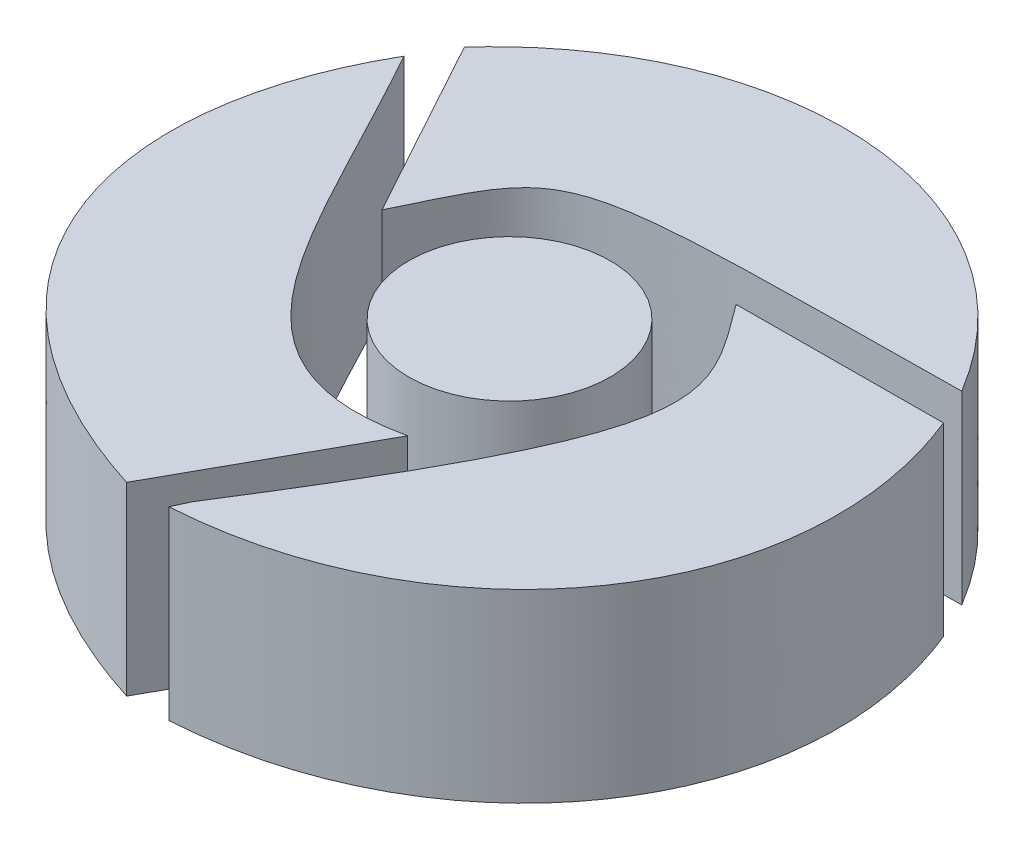
ISO-10303-21;
HEADER;
FILE_DESCRIPTION(('STEP AP214'),'2;1');
FILE_NAME('part.step','',(''),(''),'','','');
FILE_SCHEMA(('AUTOMOTIVE_DESIGN { 1 0 10303 214 1 1 1 1 }'));
ENDSEC;
DATA;
#1=APPLICATION_CONTEXT('core data for automotive mechanical design processes');
#2=APPLICATION_PROTOCOL_DEFINITION('international standard','automotive_design',2000,#1);
#3=PRODUCT_CONTEXT('',#1,'mechanical');
#4=PRODUCT('Part','Part','',(#3));
#5=PRODUCT_RELATED_PRODUCT_CATEGORY('part','',(#4));
#6=PRODUCT_DEFINITION_FORMATION('','',#4);
#7=PRODUCT_DEFINITION_CONTEXT('part definition',#1,'design');
#8=PRODUCT_DEFINITION('design','',#6,#7);
#9=PRODUCT_DEFINITION_SHAPE('','',#8);
#10=(LENGTH_UNIT() NAMED_UNIT(*) SI_UNIT(.MILLI.,.METRE.));
#11=(NAMED_UNIT(*) PLANE_ANGLE_UNIT() SI_UNIT($,.RADIAN.));
#12=(NAMED_UNIT(*) SI_UNIT($,.STERADIAN.) SOLID_ANGLE_UNIT());
#13=UNCERTAINTY_MEASURE_WITH_UNIT(LENGTH_MEASURE(1.E-05),#10,'distance_accuracy_value','');
#14=(GEOMETRIC_REPRESENTATION_CONTEXT(3) GLOBAL_UNCERTAINTY_ASSIGNED_CONTEXT((#13)) GLOBAL_UNIT_ASSIGNED_CONTEXT((#10,
#11,#12)) REPRESENTATION_CONTEXT('',''));
#15=CARTESIAN_POINT('',(0.,0.,0.));
#16=DIRECTION('',(0.,0.,1.));
#17=DIRECTION('',(1.,0.,0.));
#18=AXIS2_PLACEMENT_3D('',#15,#16,#17);
#19=CARTESIAN_POINT('',(4.49369282645748,2.,-4.37720896751852));
#20=DIRECTION('',(0.,-1.,0.));
#21=DIRECTION('',(0.,0.,-1.));
#22=AXIS2_PLACEMENT_3D('',#19,#20,#21);
#23=CYLINDRICAL_SURFACE('',#22,1.08827277645075);
#24=CARTESIAN_POINT('',(4.49369282645748,2.,-4.37720896751852));
#25=DIRECTION('',(0.,1.,0.));
#26=DIRECTION('',(0.,0.,1.));
#27=AXIS2_PLACEMENT_3D('',#24,#25,#26);
#28=CIRCLE('',#27,1.08827277645075);
#29=CARTESIAN_POINT('',(4.49369282645748,2.,-3.28893619106777));
#30=VERTEX_POINT('',#29);
#31=EDGE_CURVE('E11',#30,#30,#28,.T.);
#32=ORIENTED_EDGE('',*,*,#31,.F.);
#33=EDGE_LOOP('',(#32));
#34=FACE_BOUND('',#33,.T.);
#35=CARTESIAN_POINT('',(4.49369282645748,0.,-4.37720896751852));
#36=DIRECTION('',(0.,1.,0.));
#37=DIRECTION('',(0.,0.,1.));
#38=AXIS2_PLACEMENT_3D('',#35,#36,#37);
#39=CIRCLE('',#38,1.08827277645075);
#40=CARTESIAN_POINT('',(4.49369282645748,0.,-3.28893619106777));
#41=VERTEX_POINT('',#40);
#42=EDGE_CURVE('E45',#41,#41,#39,.T.);
#43=ORIENTED_EDGE('',*,*,#42,.T.);
#44=EDGE_LOOP('',(#43));
#45=FACE_BOUND('',#44,.T.);
#46=ADVANCED_FACE('F42',(#34,#45),#23,.T.);
#47=CARTESIAN_POINT('',(4.49369282645748,2.,-4.37720896751852));
#48=DIRECTION('',(0.,1.,0.));
#49=DIRECTION('',(0.,0.,1.));
#50=AXIS2_PLACEMENT_3D('',#47,#48,#49);
#51=PLANE('',#50);
#52=ORIENTED_EDGE('',*,*,#31,.T.);
#53=EDGE_LOOP('',(#52));
#54=FACE_BOUND('',#53,.T.);
#55=ADVANCED_FACE('F57',(#54),#51,.T.);
#56=CARTESIAN_POINT('',(4.49369282645748,0.,-4.37720896751852));
#57=DIRECTION('',(0.,1.,0.));
#58=DIRECTION('',(0.,0.,1.));
#59=AXIS2_PLACEMENT_3D('',#56,#57,#58);
#60=PLANE('',#59);
#61=ORIENTED_EDGE('',*,*,#42,.F.);
#62=EDGE_LOOP('',(#61));
#63=FACE_BOUND('',#62,.T.);
#64=ADVANCED_FACE('F55',(#63),#60,.F.);
#65=CLOSED_SHELL('',(#46,#55,#64));
#66=MANIFOLD_SOLID_BREP('B2',#65);
#67=CARTESIAN_POINT('',(1.46568379062687,2.,-6.26357875654493));
#68=CARTESIAN_POINT('',(0.26002460336743,2.,-4.18208314282735));
#69=CARTESIAN_POINT('',(0.973294195518778,2.,-1.73068737006509));
#70=CARTESIAN_POINT('',(3.95488453371398,2.,-0.780285592337409));
#71=B_SPLINE_CURVE_WITH_KNOTS('',3,(#67,#68,#69,#70),.UNSPECIFIED.,.F.,.F.,(4,4),(0.,1.),.UNSPECIFIED.);
#72=DIRECTION('',(0.,-1.,0.));
#73=VECTOR('',#72,1.);
#74=SURFACE_OF_LINEAR_EXTRUSION('',#71,#73);
#75=CARTESIAN_POINT('',(1.46568379062687,0.,-6.26357875654493));
#76=CARTESIAN_POINT('',(0.26002460336743,0.,-4.18208314282735));
#77=CARTESIAN_POINT('',(0.973294195518778,0.,-1.73068737006509));
#78=CARTESIAN_POINT('',(3.95488453371398,0.,-0.780285592337409));
#79=B_SPLINE_CURVE_WITH_KNOTS('',3,(#75,#76,#77,#78),.UNSPECIFIED.,.F.,.F.,(4,4),(0.,1.),.UNSPECIFIED.);
#80=CARTESIAN_POINT('',(1.46568379062687,0.,-6.26357875654493));
#81=VERTEX_POINT('',#80);
#82=CARTESIAN_POINT('',(3.95488453371398,0.,-0.780285592337409));
#83=VERTEX_POINT('',#82);
#84=EDGE_CURVE('E140',#81,#83,#79,.T.);
#85=ORIENTED_EDGE('',*,*,#84,.T.);
#86=DIRECTION('',(0.,-1.,0.));
#87=VECTOR('',#86,1.);
#88=CARTESIAN_POINT('',(3.95488453371398,2.,-0.780285592337409));
#89=LINE('',#88,#87);
#90=CARTESIAN_POINT('',(3.95488453371398,2.,-0.780285592337409));
#91=VERTEX_POINT('',#90);
#92=EDGE_CURVE('E40',#91,#83,#89,.T.);
#93=ORIENTED_EDGE('',*,*,#92,.F.);
#94=CARTESIAN_POINT('',(1.46568379062687,2.,-6.26357875654493));
#95=VERTEX_POINT('',#94);
#96=EDGE_CURVE('E134',#95,#91,#71,.T.);
#97=ORIENTED_EDGE('',*,*,#96,.F.);
#98=DIRECTION('',(0.,-1.,0.));
#99=VECTOR('',#98,1.);
#100=CARTESIAN_POINT('',(1.46568379062687,2.,-6.26357875654493));
#101=LINE('',#100,#99);
#102=EDGE_CURVE('E141',#95,#81,#101,.T.);
#103=ORIENTED_EDGE('',*,*,#102,.T.);
#104=EDGE_LOOP('',(#85,#93,#97,#103));
#105=FACE_BOUND('',#104,.T.);
#106=ADVANCED_FACE('F93',(#105),#74,.F.);
#107=CARTESIAN_POINT('',(3.95488453371398,2.,-0.780285592337409));
#108=DIRECTION('',(-0.874737866213377,0.,-0.484596394345302));
#109=DIRECTION('',(-0.484596394345302,0.,0.874737866213378));
#110=AXIS2_PLACEMENT_3D('',#107,#108,#109);
#111=PLANE('',#110);
#112=CARTESIAN_POINT('',(3.95488453371398,0.,-0.780285592337409));
#113=CARTESIAN_POINT('',(5.03689825272289,0.,-2.73341273654196));
#114=B_SPLINE_CURVE_WITH_KNOTS('',1,(#112,#113),.UNSPECIFIED.,.F.,.F.,(2,2),(0.,1.),.UNSPECIFIED.);
#115=CARTESIAN_POINT('',(5.0368982527229,0.,-2.73341273654196));
#116=VERTEX_POINT('',#115);
#117=EDGE_CURVE('E122',#83,#116,#114,.T.);
#118=ORIENTED_EDGE('',*,*,#117,.T.);
#119=DIRECTION('',(0.,-1.,0.));
#120=VECTOR('',#119,1.);
#121=CARTESIAN_POINT('',(5.0368982527229,2.,-2.73341273654196));
#122=LINE('',#121,#120);
#123=CARTESIAN_POINT('',(5.0368982527229,2.,-2.73341273654196));
#124=VERTEX_POINT('',#123);
#125=EDGE_CURVE('E102',#124,#116,#122,.T.);
#126=ORIENTED_EDGE('',*,*,#125,.F.);
#127=CARTESIAN_POINT('',(3.95488453371398,2.,-0.780285592337409));
#128=CARTESIAN_POINT('',(5.03689825272289,2.,-2.73341273654196));
#129=B_SPLINE_CURVE_WITH_KNOTS('',1,(#127,#128),.UNSPECIFIED.,.F.,.F.,(2,2),(0.,1.),.UNSPECIFIED.);
#130=EDGE_CURVE('E130',#91,#124,#129,.T.);
#131=ORIENTED_EDGE('',*,*,#130,.F.);
#132=ORIENTED_EDGE('',*,*,#92,.T.);
#133=EDGE_LOOP('',(#118,#126,#131,#132));
#134=FACE_BOUND('',#133,.T.);
#135=ADVANCED_FACE('F131',(#134),#111,.F.);
#136=CARTESIAN_POINT('',(5.0368982527229,2.,-2.73341273654196));
#137=CARTESIAN_POINT('',(3.18422661949792,2.,-2.33338422310833));
#138=CARTESIAN_POINT('',(2.68556761317873,2.,-4.09709907646247));
#139=CARTESIAN_POINT('',(1.46568379062687,2.,-6.26357875654493));
#140=B_SPLINE_CURVE_WITH_KNOTS('',3,(#136,#137,#138,#139),.UNSPECIFIED.,.F.,.F.,(4,4),(0.,1.),.UNSPECIFIED.);
#141=DIRECTION('',(0.,-1.,0.));
#142=VECTOR('',#141,1.);
#143=SURFACE_OF_LINEAR_EXTRUSION('',#140,#142);
#144=CARTESIAN_POINT('',(5.0368982527229,0.,-2.73341273654196));
#145=CARTESIAN_POINT('',(3.18422661949792,0.,-2.33338422310833));
#146=CARTESIAN_POINT('',(2.68556761317873,0.,-4.09709907646247));
#147=CARTESIAN_POINT('',(1.46568379062687,0.,-6.26357875654493));
#148=B_SPLINE_CURVE_WITH_KNOTS('',3,(#144,#145,#146,#147),.UNSPECIFIED.,.F.,.F.,(4,4),(0.,1.),.UNSPECIFIED.);
#149=EDGE_CURVE('E127',#116,#81,#148,.T.);
#150=ORIENTED_EDGE('',*,*,#149,.T.);
#151=ORIENTED_EDGE('',*,*,#102,.F.);
#152=EDGE_CURVE('E110',#124,#95,#140,.T.);
#153=ORIENTED_EDGE('',*,*,#152,.F.);
#154=ORIENTED_EDGE('',*,*,#125,.T.);
#155=EDGE_LOOP('',(#150,#151,#153,#154));
#156=FACE_BOUND('',#155,.T.);
#157=ADVANCED_FACE('F166',(#156),#143,.F.);
#158=CARTESIAN_POINT('',(1.14006559012493,2.,-3.09777198594496));
#159=DIRECTION('',(0.,-1.,0.));
#160=DIRECTION('',(0.,0.,-1.));
#161=AXIS2_PLACEMENT_3D('',#158,#159,#160);
#162=PLANE('',#161);
#163=ORIENTED_EDGE('',*,*,#96,.T.);
#164=ORIENTED_EDGE('',*,*,#130,.T.);
#165=ORIENTED_EDGE('',*,*,#152,.T.);
#166=EDGE_LOOP('',(#163,#164,#165));
#167=FACE_BOUND('',#166,.T.);
#168=ADVANCED_FACE('F137',(#167),#162,.F.);
#169=CARTESIAN_POINT('',(1.14006559012493,0.,-3.09777198594496));
#170=DIRECTION('',(0.,-1.,0.));
#171=DIRECTION('',(0.,0.,-1.));
#172=AXIS2_PLACEMENT_3D('',#169,#170,#171);
#173=PLANE('',#172);
#174=ORIENTED_EDGE('',*,*,#84,.F.);
#175=ORIENTED_EDGE('',*,*,#149,.F.);
#176=ORIENTED_EDGE('',*,*,#117,.F.);
#177=EDGE_LOOP('',(#174,#175,#176));
#178=FACE_BOUND('',#177,.T.);
#179=ADVANCED_FACE('F167',(#178),#173,.T.);
#180=CLOSED_SHELL('',(#106,#135,#157,#168,#179));
#181=MANIFOLD_SOLID_BREP('B6',#180);
#182=CARTESIAN_POINT('',(5.58196560290823,2.,-5.73657430058232));
#183=CARTESIAN_POINT('',(6.35568947843554,2.,-4.69227354983184));
#184=CARTESIAN_POINT('',(6.68715091956496,2.,-4.42206904904929));
#185=CARTESIAN_POINT('',(4.49369282645747,2.,-0.957799974382336));
#186=B_SPLINE_CURVE_WITH_KNOTS('',3,(#182,#183,#184,#185),.UNSPECIFIED.,.F.,.F.,(4,4),(0.,1.),.UNSPECIFIED.);
#187=DIRECTION('',(0.,-1.,0.));
#188=VECTOR('',#187,1.);
#189=SURFACE_OF_LINEAR_EXTRUSION('',#186,#188);
#190=CARTESIAN_POINT('',(5.58196560290823,0.,-5.73657430058232));
#191=CARTESIAN_POINT('',(6.35568947843554,0.,-4.69227354983184));
#192=CARTESIAN_POINT('',(6.68715091956496,0.,-4.42206904904929));
#193=CARTESIAN_POINT('',(4.49369282645747,0.,-0.957799974382336));
#194=B_SPLINE_CURVE_WITH_KNOTS('',3,(#190,#191,#192,#193),.UNSPECIFIED.,.F.,.F.,(4,4),(0.,1.),.UNSPECIFIED.);
#195=CARTESIAN_POINT('',(5.58196560290823,0.,-5.73657430058232));
#196=VERTEX_POINT('',#195);
#197=CARTESIAN_POINT('',(4.49369282645748,0.,-0.95779997438235));
#198=VERTEX_POINT('',#197);
#199=EDGE_CURVE('E319',#196,#198,#194,.T.);
#200=ORIENTED_EDGE('',*,*,#199,.T.);
#201=DIRECTION('',(0.,-1.,0.));
#202=VECTOR('',#201,1.);
#203=CARTESIAN_POINT('',(4.49369282645748,2.,-0.95779997438235));
#204=LINE('',#203,#202);
#205=CARTESIAN_POINT('',(4.49369282645748,2.,-0.95779997438235));
#206=VERTEX_POINT('',#205);
#207=EDGE_CURVE('E91',#206,#198,#204,.T.);
#208=ORIENTED_EDGE('',*,*,#207,.F.);
#209=CARTESIAN_POINT('',(5.58196560290823,2.,-5.73657430058232));
#210=VERTEX_POINT('',#209);
#211=EDGE_CURVE('E284',#210,#206,#186,.T.);
#212=ORIENTED_EDGE('',*,*,#211,.F.);
#213=DIRECTION('',(0.,-1.,0.));
#214=VECTOR('',#213,1.);
#215=CARTESIAN_POINT('',(5.58196560290823,2.,-5.73657430058232));
#216=LINE('',#215,#214);
#217=EDGE_CURVE('E292',#210,#196,#216,.T.);
#218=ORIENTED_EDGE('',*,*,#217,.T.);
#219=EDGE_LOOP('',(#200,#208,#212,#218));
#220=FACE_BOUND('',#219,.T.);
#221=ADVANCED_FACE('F232',(#220),#189,.F.);
#222=CARTESIAN_POINT('',(4.49369282645748,2.,-0.95779997438235));
#223=DIRECTION('',(0.907330835705785,0.,0.420417357607226));
#224=DIRECTION('',(0.420417357607226,0.,-0.907330835705785));
#225=AXIS2_PLACEMENT_3D('',#222,#223,#224);
#226=PLANE('',#225);
#227=CARTESIAN_POINT('',(4.49369282645748,0.,-0.95779997438235));
#228=CARTESIAN_POINT('',(4.41144043901541,0.,-0.780285592337409));
#229=B_SPLINE_CURVE_WITH_KNOTS('',1,(#227,#228),.UNSPECIFIED.,.F.,.F.,(2,2),(0.,1.),.UNSPECIFIED.);
#230=CARTESIAN_POINT('',(4.4114404390154,0.,-0.780285592337409));
#231=VERTEX_POINT('',#230);
#232=EDGE_CURVE('E288',#198,#231,#229,.T.);
#233=ORIENTED_EDGE('',*,*,#232,.T.);
#234=DIRECTION('',(0.,-1.,0.));
#235=VECTOR('',#234,1.);
#236=CARTESIAN_POINT('',(4.4114404390154,2.,-0.780285592337409));
#237=LINE('',#236,#235);
#238=CARTESIAN_POINT('',(4.4114404390154,2.,-0.780285592337409));
#239=VERTEX_POINT('',#238);
#240=EDGE_CURVE('E241',#239,#231,#237,.T.);
#241=ORIENTED_EDGE('',*,*,#240,.F.);
#242=CARTESIAN_POINT('',(4.49369282645748,2.,-0.95779997438235));
#243=CARTESIAN_POINT('',(4.41144043901541,2.,-0.780285592337409));
#244=B_SPLINE_CURVE_WITH_KNOTS('',1,(#242,#243),.UNSPECIFIED.,.F.,.F.,(2,2),(0.,1.),.UNSPECIFIED.);
#245=EDGE_CURVE('E279',#206,#239,#244,.T.);
#246=ORIENTED_EDGE('',*,*,#245,.F.);
#247=ORIENTED_EDGE('',*,*,#207,.T.);
#248=EDGE_LOOP('',(#233,#241,#246,#247));
#249=FACE_BOUND('',#248,.T.);
#250=ADVANCED_FACE('F287',(#249),#226,.F.);
#251=CARTESIAN_POINT('',(4.4114404390154,2.,-0.780285592337409));
#252=CARTESIAN_POINT('',(7.16628040789659,2.,-0.951883368176808));
#253=CARTESIAN_POINT('',(8.79317476192859,2.,-3.31586312099102));
#254=CARTESIAN_POINT('',(7.8101444496985,2.,-5.7478848531041));
#255=B_SPLINE_CURVE_WITH_KNOTS('',3,(#251,#252,#253,#254),.UNSPECIFIED.,.F.,.F.,(4,4),(0.,1.),.UNSPECIFIED.);
#256=DIRECTION('',(0.,-1.,0.));
#257=VECTOR('',#256,1.);
#258=SURFACE_OF_LINEAR_EXTRUSION('',#255,#257);
#259=CARTESIAN_POINT('',(4.4114404390154,0.,-0.780285592337409));
#260=CARTESIAN_POINT('',(7.16628040789659,0.,-0.951883368176808));
#261=CARTESIAN_POINT('',(8.79317476192859,0.,-3.31586312099102));
#262=CARTESIAN_POINT('',(7.8101444496985,0.,-5.7478848531041));
#263=B_SPLINE_CURVE_WITH_KNOTS('',3,(#259,#260,#261,#262),.UNSPECIFIED.,.F.,.F.,(4,4),(0.,1.),.UNSPECIFIED.);
#264=CARTESIAN_POINT('',(7.8101444496985,0.,-5.7478848531041));
#265=VERTEX_POINT('',#264);
#266=EDGE_CURVE('E266',#231,#265,#263,.T.);
#267=ORIENTED_EDGE('',*,*,#266,.T.);
#268=DIRECTION('',(0.,-1.,0.));
#269=VECTOR('',#268,1.);
#270=CARTESIAN_POINT('',(7.8101444496985,2.,-5.7478848531041));
#271=LINE('',#270,#269);
#272=CARTESIAN_POINT('',(7.8101444496985,2.,-5.7478848531041));
#273=VERTEX_POINT('',#272);
#274=EDGE_CURVE('E289',#273,#265,#271,.T.);
#275=ORIENTED_EDGE('',*,*,#274,.F.);
#276=EDGE_CURVE('E282',#239,#273,#255,.T.);
#277=ORIENTED_EDGE('',*,*,#276,.F.);
#278=ORIENTED_EDGE('',*,*,#240,.T.);
#279=EDGE_LOOP('',(#267,#275,#277,#278));
#280=FACE_BOUND('',#279,.T.);
#281=ADVANCED_FACE('F290',(#280),#258,.F.);
#282=CARTESIAN_POINT('',(7.8101444496985,2.,-5.7478848531041));
#283=DIRECTION('',(0.00507607673421141,0.,0.999987116639504));
#284=DIRECTION('',(0.999987116639504,0.,-0.00507607673421141));
#285=AXIS2_PLACEMENT_3D('',#282,#283,#284);
#286=PLANE('',#285);
#287=CARTESIAN_POINT('',(7.8101444496985,0.,-5.7478848531041));
#288=CARTESIAN_POINT('',(5.58196560290823,0.,-5.73657430058232));
#289=B_SPLINE_CURVE_WITH_KNOTS('',1,(#287,#288),.UNSPECIFIED.,.F.,.F.,(2,2),(0.,1.),.UNSPECIFIED.);
#290=EDGE_CURVE('E272',#265,#196,#289,.T.);
#291=ORIENTED_EDGE('',*,*,#290,.T.);
#292=ORIENTED_EDGE('',*,*,#217,.F.);
#293=CARTESIAN_POINT('',(7.8101444496985,2.,-5.7478848531041));
#294=CARTESIAN_POINT('',(5.58196560290823,2.,-5.73657430058232));
#295=B_SPLINE_CURVE_WITH_KNOTS('',1,(#293,#294),.UNSPECIFIED.,.F.,.F.,(2,2),(0.,1.),.UNSPECIFIED.);
#296=EDGE_CURVE('E249',#273,#210,#295,.T.);
#297=ORIENTED_EDGE('',*,*,#296,.F.);
#298=ORIENTED_EDGE('',*,*,#274,.T.);
#299=EDGE_LOOP('',(#291,#292,#297,#298));
#300=FACE_BOUND('',#299,.T.);
#301=ADVANCED_FACE('F308',(#300),#286,.F.);
#302=CARTESIAN_POINT('',(6.1505224529209,2.,-4.25467525895101));
#303=DIRECTION('',(0.,-1.,0.));
#304=DIRECTION('',(0.,0.,-1.));
#305=AXIS2_PLACEMENT_3D('',#302,#303,#304);
#306=PLANE('',#305);
#307=ORIENTED_EDGE('',*,*,#211,.T.);
#308=ORIENTED_EDGE('',*,*,#245,.T.);
#309=ORIENTED_EDGE('',*,*,#276,.T.);
#310=ORIENTED_EDGE('',*,*,#296,.T.);
#311=EDGE_LOOP('',(#307,#308,#309,#310));
#312=FACE_BOUND('',#311,.T.);
#313=ADVANCED_FACE('F280',(#312),#306,.F.);
#314=CARTESIAN_POINT('',(6.1505224529209,0.,-4.25467525895101));
#315=DIRECTION('',(0.,-1.,0.));
#316=DIRECTION('',(0.,0.,-1.));
#317=AXIS2_PLACEMENT_3D('',#314,#315,#316);
#318=PLANE('',#317);
#319=ORIENTED_EDGE('',*,*,#199,.F.);
#320=ORIENTED_EDGE('',*,*,#290,.F.);
#321=ORIENTED_EDGE('',*,*,#266,.F.);
#322=ORIENTED_EDGE('',*,*,#232,.F.);
#323=EDGE_LOOP('',(#319,#320,#321,#322));
#324=FACE_BOUND('',#323,.T.);
#325=ADVANCED_FACE('F346',(#324),#318,.T.);
#326=CLOSED_SHELL('',(#221,#250,#281,#301,#313,#325));
#327=MANIFOLD_SOLID_BREP('B34',#326);
#328=CARTESIAN_POINT('',(7.61220978056739,2.,-6.14375419136633));
#329=CARTESIAN_POINT('',(6.25494477381171,2.,-8.40586253595912));
#330=CARTESIAN_POINT('',(3.39049205219003,2.,-8.54873880775381));
#331=CARTESIAN_POINT('',(1.70830273576496,2.,-6.67502032180364));
#332=B_SPLINE_CURVE_WITH_KNOTS('',3,(#328,#329,#330,#331),.UNSPECIFIED.,.F.,.F.,(4,4),(0.,1.),.UNSPECIFIED.);
#333=DIRECTION('',(0.,-1.,0.));
#334=VECTOR('',#333,1.);
#335=SURFACE_OF_LINEAR_EXTRUSION('',#332,#334);
#336=CARTESIAN_POINT('',(7.61220978056739,0.,-6.14375419136633));
#337=CARTESIAN_POINT('',(6.25494477381171,0.,-8.40586253595912));
#338=CARTESIAN_POINT('',(3.39049205219003,0.,-8.54873880775381));
#339=CARTESIAN_POINT('',(1.70830273576496,0.,-6.67502032180364));
#340=B_SPLINE_CURVE_WITH_KNOTS('',3,(#336,#337,#338,#339),.UNSPECIFIED.,.F.,.F.,(4,4),(0.,1.),.UNSPECIFIED.);
#341=CARTESIAN_POINT('',(7.6122097805674,0.,-6.14375419136633));
#342=VERTEX_POINT('',#341);
#343=CARTESIAN_POINT('',(1.70830273576496,0.,-6.67502032180364));
#344=VERTEX_POINT('',#343);
#345=EDGE_CURVE('E445',#342,#344,#340,.T.);
#346=ORIENTED_EDGE('',*,*,#345,.T.);
#347=DIRECTION('',(0.,-1.,0.));
#348=VECTOR('',#347,1.);
#349=CARTESIAN_POINT('',(1.70830273576496,2.,-6.67502032180364));
#350=LINE('',#349,#348);
#351=CARTESIAN_POINT('',(1.70830273576496,2.,-6.67502032180364));
#352=VERTEX_POINT('',#351);
#353=EDGE_CURVE('E230',#352,#344,#350,.T.);
#354=ORIENTED_EDGE('',*,*,#353,.F.);
#355=CARTESIAN_POINT('',(7.6122097805674,2.,-6.14375419136633));
#356=VERTEX_POINT('',#355);
#357=EDGE_CURVE('E439',#356,#352,#332,.T.);
#358=ORIENTED_EDGE('',*,*,#357,.F.);
#359=DIRECTION('',(0.,-1.,0.));
#360=VECTOR('',#359,1.);
#361=CARTESIAN_POINT('',(7.6122097805674,2.,-6.14375419136633));
#362=LINE('',#361,#360);
#363=EDGE_CURVE('E446',#356,#342,#362,.T.);
#364=ORIENTED_EDGE('',*,*,#363,.T.);
#365=EDGE_LOOP('',(#346,#354,#358,#364));
#366=FACE_BOUND('',#365,.T.);
#367=ADVANCED_FACE('F398',(#366),#335,.F.);
#368=CARTESIAN_POINT('',(1.70830273576496,2.,-6.67502032180364));
#369=DIRECTION('',(0.877160481771346,0.,-0.480197344035408));
#370=DIRECTION('',(-0.480197344035408,0.,-0.877160481771346));
#371=AXIS2_PLACEMENT_3D('',#368,#369,#370);
#372=PLANE('',#371);
#373=CARTESIAN_POINT('',(1.70830273576496,0.,-6.67502032180364));
#374=CARTESIAN_POINT('',(2.78507689985087,0.,-4.70811284874004));
#375=B_SPLINE_CURVE_WITH_KNOTS('',1,(#373,#374),.UNSPECIFIED.,.F.,.F.,(2,2),(0.,1.),.UNSPECIFIED.);
#376=CARTESIAN_POINT('',(2.78507689985087,0.,-4.70811284874004));
#377=VERTEX_POINT('',#376);
#378=EDGE_CURVE('E427',#344,#377,#375,.T.);
#379=ORIENTED_EDGE('',*,*,#378,.T.);
#380=DIRECTION('',(0.,-1.,0.));
#381=VECTOR('',#380,1.);
#382=CARTESIAN_POINT('',(2.78507689985087,2.,-4.70811284874004));
#383=LINE('',#382,#381);
#384=CARTESIAN_POINT('',(2.78507689985087,2.,-4.70811284874004));
#385=VERTEX_POINT('',#384);
#386=EDGE_CURVE('E407',#385,#377,#383,.T.);
#387=ORIENTED_EDGE('',*,*,#386,.F.);
#388=CARTESIAN_POINT('',(1.70830273576496,2.,-6.67502032180364));
#389=CARTESIAN_POINT('',(2.78507689985087,2.,-4.70811284874004));
#390=B_SPLINE_CURVE_WITH_KNOTS('',1,(#388,#389),.UNSPECIFIED.,.F.,.F.,(2,2),(0.,1.),.UNSPECIFIED.);
#391=EDGE_CURVE('E435',#352,#385,#390,.T.);
#392=ORIENTED_EDGE('',*,*,#391,.F.);
#393=ORIENTED_EDGE('',*,*,#353,.T.);
#394=EDGE_LOOP('',(#379,#387,#392,#393));
#395=FACE_BOUND('',#394,.T.);
#396=ADVANCED_FACE('F436',(#395),#372,.F.);
#397=CARTESIAN_POINT('',(2.78507689985087,2.,-4.70811284874004));
#398=CARTESIAN_POINT('',(3.5030279530807,2.,-6.18454420977161));
#399=CARTESIAN_POINT('',(3.25057796531638,2.,-6.08720142876988));
#400=CARTESIAN_POINT('',(7.6122097805674,2.,-6.14375419136633));
#401=B_SPLINE_CURVE_WITH_KNOTS('',3,(#397,#398,#399,#400),.UNSPECIFIED.,.F.,.F.,(4,4),(0.,1.),.UNSPECIFIED.);
#402=DIRECTION('',(0.,-1.,0.));
#403=VECTOR('',#402,1.);
#404=SURFACE_OF_LINEAR_EXTRUSION('',#401,#403);
#405=CARTESIAN_POINT('',(2.78507689985087,0.,-4.70811284874004));
#406=CARTESIAN_POINT('',(3.5030279530807,0.,-6.18454420977161));
#407=CARTESIAN_POINT('',(3.25057796531638,0.,-6.08720142876988));
#408=CARTESIAN_POINT('',(7.6122097805674,0.,-6.14375419136633));
#409=B_SPLINE_CURVE_WITH_KNOTS('',3,(#405,#406,#407,#408),.UNSPECIFIED.,.F.,.F.,(4,4),(0.,1.),.UNSPECIFIED.);
#410=EDGE_CURVE('E432',#377,#342,#409,.T.);
#411=ORIENTED_EDGE('',*,*,#410,.T.);
#412=ORIENTED_EDGE('',*,*,#363,.F.);
#413=EDGE_CURVE('E415',#385,#356,#401,.T.);
#414=ORIENTED_EDGE('',*,*,#413,.F.);
#415=ORIENTED_EDGE('',*,*,#386,.T.);
#416=EDGE_LOOP('',(#411,#412,#414,#415));
#417=FACE_BOUND('',#416,.T.);
#418=ADVANCED_FACE('F471',(#417),#404,.F.);
#419=CARTESIAN_POINT('',(4.7821028742922,2.,-7.96032231803859));
#420=DIRECTION('',(0.,-1.,0.));
#421=DIRECTION('',(0.,0.,-1.));
#422=AXIS2_PLACEMENT_3D('',#419,#420,#421);
#423=PLANE('',#422);
#424=ORIENTED_EDGE('',*,*,#357,.T.);
#425=ORIENTED_EDGE('',*,*,#391,.T.);
#426=ORIENTED_EDGE('',*,*,#413,.T.);
#427=EDGE_LOOP('',(#424,#425,#426));
#428=FACE_BOUND('',#427,.T.);
#429=ADVANCED_FACE('F442',(#428),#423,.F.);
#430=CARTESIAN_POINT('',(4.7821028742922,0.,-7.96032231803859));
#431=DIRECTION('',(0.,-1.,0.));
#432=DIRECTION('',(0.,0.,-1.));
#433=AXIS2_PLACEMENT_3D('',#430,#431,#432);
#434=PLANE('',#433);
#435=ORIENTED_EDGE('',*,*,#345,.F.);
#436=ORIENTED_EDGE('',*,*,#410,.F.);
#437=ORIENTED_EDGE('',*,*,#378,.F.);
#438=EDGE_LOOP('',(#435,#436,#437));
#439=FACE_BOUND('',#438,.T.);
#440=ADVANCED_FACE('F472',(#439),#434,.T.);
#441=CLOSED_SHELL('',(#367,#396,#418,#429,#440));
#442=MANIFOLD_SOLID_BREP('B85',#441);
#443=ADVANCED_BREP_SHAPE_REPRESENTATION('',(#18,#66,#181,#327,#442),#14);
#444=SHAPE_DEFINITION_REPRESENTATION(#9,#443);
ENDSEC;
END-ISO-10303-21;
